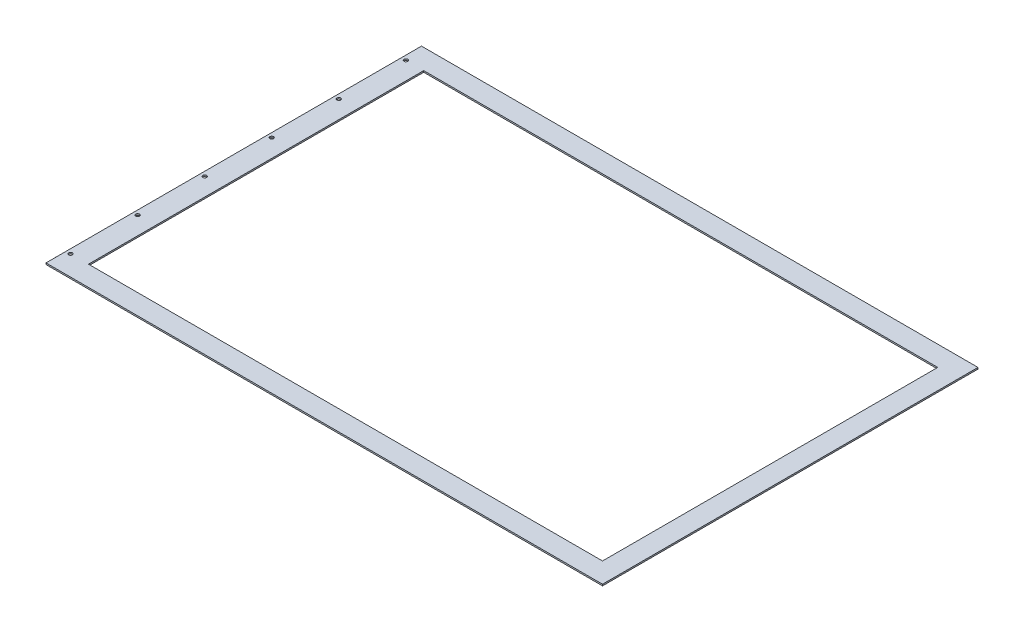
ISO-10303-21;
HEADER;
FILE_DESCRIPTION(('STEP AP214'),'2;1');
FILE_NAME('part.step','',(''),(''),'','','');
FILE_SCHEMA(('AUTOMOTIVE_DESIGN { 1 0 10303 214 1 1 1 1 }'));
ENDSEC;
DATA;
#1=APPLICATION_CONTEXT('core data for automotive mechanical design processes');
#2=APPLICATION_PROTOCOL_DEFINITION('international standard','automotive_design',2000,#1);
#3=PRODUCT_CONTEXT('',#1,'mechanical');
#4=PRODUCT('Part','Part','',(#3));
#5=PRODUCT_RELATED_PRODUCT_CATEGORY('part','',(#4));
#6=PRODUCT_DEFINITION_FORMATION('','',#4);
#7=PRODUCT_DEFINITION_CONTEXT('part definition',#1,'design');
#8=PRODUCT_DEFINITION('design','',#6,#7);
#9=PRODUCT_DEFINITION_SHAPE('','',#8);
#10=(LENGTH_UNIT() NAMED_UNIT(*) SI_UNIT(.MILLI.,.METRE.));
#11=(NAMED_UNIT(*) PLANE_ANGLE_UNIT() SI_UNIT($,.RADIAN.));
#12=(NAMED_UNIT(*) SI_UNIT($,.STERADIAN.) SOLID_ANGLE_UNIT());
#13=UNCERTAINTY_MEASURE_WITH_UNIT(LENGTH_MEASURE(1.E-05),#10,'distance_accuracy_value','');
#14=(GEOMETRIC_REPRESENTATION_CONTEXT(3) GLOBAL_UNCERTAINTY_ASSIGNED_CONTEXT((#13)) GLOBAL_UNIT_ASSIGNED_CONTEXT((#10,
#11,#12)) REPRESENTATION_CONTEXT('',''));
#15=CARTESIAN_POINT('',(0.,0.,0.));
#16=DIRECTION('',(0.,0.,1.));
#17=DIRECTION('',(1.,0.,0.));
#18=AXIS2_PLACEMENT_3D('',#15,#16,#17);
#19=CARTESIAN_POINT('',(0.,2.54,0.));
#20=DIRECTION('',(0.,-1.,0.));
#21=DIRECTION('',(0.,0.,-1.));
#22=AXIS2_PLACEMENT_3D('',#19,#20,#21);
#23=PLANE('',#22);
#24=CARTESIAN_POINT('',(-468.63,2.54,285.75));
#25=DIRECTION('',(0.,1.,0.));
#26=DIRECTION('',(0.,0.,1.));
#27=AXIS2_PLACEMENT_3D('',#24,#25,#26);
#28=CIRCLE('',#27,3.17499999999998);
#29=CARTESIAN_POINT('',(-468.63,2.54,288.925));
#30=VERTEX_POINT('',#29);
#31=EDGE_CURVE('E290',#30,#30,#28,.T.);
#32=ORIENTED_EDGE('',*,*,#31,.F.);
#33=EDGE_LOOP('',(#32));
#34=FACE_BOUND('',#33,.T.);
#35=CARTESIAN_POINT('',(-468.63,2.54,171.45));
#36=DIRECTION('',(0.,1.,0.));
#37=DIRECTION('',(0.,0.,1.));
#38=AXIS2_PLACEMENT_3D('',#35,#36,#37);
#39=CIRCLE('',#38,3.17499999999998);
#40=CARTESIAN_POINT('',(-468.63,2.54,174.625));
#41=VERTEX_POINT('',#40);
#42=EDGE_CURVE('E294',#41,#41,#39,.T.);
#43=ORIENTED_EDGE('',*,*,#42,.F.);
#44=EDGE_LOOP('',(#43));
#45=FACE_BOUND('',#44,.T.);
#46=CARTESIAN_POINT('',(-468.63,2.54,57.15));
#47=DIRECTION('',(0.,1.,0.));
#48=DIRECTION('',(0.,0.,1.));
#49=AXIS2_PLACEMENT_3D('',#46,#47,#48);
#50=CIRCLE('',#49,3.17499999999998);
#51=CARTESIAN_POINT('',(-468.63,2.54,60.325));
#52=VERTEX_POINT('',#51);
#53=EDGE_CURVE('E304',#52,#52,#50,.T.);
#54=ORIENTED_EDGE('',*,*,#53,.F.);
#55=EDGE_LOOP('',(#54));
#56=FACE_BOUND('',#55,.T.);
#57=CARTESIAN_POINT('',(-468.63,2.54,-57.15));
#58=DIRECTION('',(0.,1.,0.));
#59=DIRECTION('',(0.,0.,1.));
#60=AXIS2_PLACEMENT_3D('',#57,#58,#59);
#61=CIRCLE('',#60,3.17499999999998);
#62=CARTESIAN_POINT('',(-468.63,2.54,-53.975));
#63=VERTEX_POINT('',#62);
#64=EDGE_CURVE('E312',#63,#63,#61,.T.);
#65=ORIENTED_EDGE('',*,*,#64,.F.);
#66=EDGE_LOOP('',(#65));
#67=FACE_BOUND('',#66,.T.);
#68=CARTESIAN_POINT('',(-468.63,2.54,-171.45));
#69=DIRECTION('',(0.,1.,0.));
#70=DIRECTION('',(0.,0.,1.));
#71=AXIS2_PLACEMENT_3D('',#68,#69,#70);
#72=CIRCLE('',#71,3.17499999999998);
#73=CARTESIAN_POINT('',(-468.63,2.54,-168.275));
#74=VERTEX_POINT('',#73);
#75=EDGE_CURVE('E320',#74,#74,#72,.T.);
#76=ORIENTED_EDGE('',*,*,#75,.F.);
#77=EDGE_LOOP('',(#76));
#78=FACE_BOUND('',#77,.T.);
#79=CARTESIAN_POINT('',(-468.63,2.54,-285.75));
#80=DIRECTION('',(0.,1.,0.));
#81=DIRECTION('',(0.,0.,1.));
#82=AXIS2_PLACEMENT_3D('',#79,#80,#81);
#83=CIRCLE('',#82,3.17499999999998);
#84=CARTESIAN_POINT('',(-468.63,2.54,-282.575));
#85=VERTEX_POINT('',#84);
#86=EDGE_CURVE('E328',#85,#85,#83,.T.);
#87=ORIENTED_EDGE('',*,*,#86,.F.);
#88=EDGE_LOOP('',(#87));
#89=FACE_BOUND('',#88,.T.);
#90=DIRECTION('',(0.,0.,-1.));
#91=VECTOR('',#90,1.);
#92=CARTESIAN_POINT('',(472.44,2.54,320.04));
#93=LINE('',#92,#91);
#94=CARTESIAN_POINT('',(472.44,2.54,320.04));
#95=VERTEX_POINT('',#94);
#96=CARTESIAN_POINT('',(472.44,2.54,-320.04));
#97=VERTEX_POINT('',#96);
#98=EDGE_CURVE('E170',#95,#97,#93,.T.);
#99=ORIENTED_EDGE('',*,*,#98,.T.);
#100=DIRECTION('',(-1.,0.,0.));
#101=VECTOR('',#100,1.);
#102=CARTESIAN_POINT('',(-472.44,2.54,-320.04));
#103=LINE('',#102,#101);
#104=CARTESIAN_POINT('',(-476.25,2.54,-320.04));
#105=VERTEX_POINT('',#104);
#106=EDGE_CURVE('E174',#97,#105,#103,.T.);
#107=ORIENTED_EDGE('',*,*,#106,.T.);
#108=DIRECTION('',(0.,0.,1.));
#109=VECTOR('',#108,1.);
#110=CARTESIAN_POINT('',(-476.25,2.54,-320.04));
#111=LINE('',#110,#109);
#112=CARTESIAN_POINT('',(-476.25,2.54,320.04));
#113=VERTEX_POINT('',#112);
#114=EDGE_CURVE('E178',#105,#113,#111,.T.);
#115=ORIENTED_EDGE('',*,*,#114,.T.);
#116=DIRECTION('',(1.,0.,0.));
#117=VECTOR('',#116,1.);
#118=CARTESIAN_POINT('',(-476.25,2.54,320.04));
#119=LINE('',#118,#117);
#120=EDGE_CURVE('E181',#113,#95,#119,.T.);
#121=ORIENTED_EDGE('',*,*,#120,.T.);
#122=EDGE_LOOP('',(#99,#107,#115,#121));
#123=FACE_BOUND('',#122,.T.);
#124=DIRECTION('',(0.,0.,-1.));
#125=VECTOR('',#124,1.);
#126=CARTESIAN_POINT('',(438.15,2.54,285.75));
#127=LINE('',#126,#125);
#128=CARTESIAN_POINT('',(438.15,2.54,285.75));
#129=VERTEX_POINT('',#128);
#130=CARTESIAN_POINT('',(438.15,2.54,-285.75));
#131=VERTEX_POINT('',#130);
#132=EDGE_CURVE('E120',#129,#131,#127,.T.);
#133=ORIENTED_EDGE('',*,*,#132,.F.);
#134=DIRECTION('',(1.,0.,0.));
#135=VECTOR('',#134,1.);
#136=CARTESIAN_POINT('',(-438.15,2.54,285.75));
#137=LINE('',#136,#135);
#138=CARTESIAN_POINT('',(-438.15,2.54,285.75));
#139=VERTEX_POINT('',#138);
#140=EDGE_CURVE('E147',#139,#129,#137,.T.);
#141=ORIENTED_EDGE('',*,*,#140,.F.);
#142=DIRECTION('',(0.,0.,1.));
#143=VECTOR('',#142,1.);
#144=CARTESIAN_POINT('',(-438.15,2.54,285.75));
#145=LINE('',#144,#143);
#146=CARTESIAN_POINT('',(-438.15,2.54,-285.75));
#147=VERTEX_POINT('',#146);
#148=EDGE_CURVE('E141',#147,#139,#145,.T.);
#149=ORIENTED_EDGE('',*,*,#148,.F.);
#150=DIRECTION('',(-1.,0.,0.));
#151=VECTOR('',#150,1.);
#152=CARTESIAN_POINT('',(-438.15,2.54,-285.75));
#153=LINE('',#152,#151);
#154=EDGE_CURVE('E129',#131,#147,#153,.T.);
#155=ORIENTED_EDGE('',*,*,#154,.F.);
#156=EDGE_LOOP('',(#133,#141,#149,#155));
#157=FACE_BOUND('',#156,.T.);
#158=ADVANCED_FACE('F43',(#34,#45,#56,#67,#78,#89,#123,#157),#23,.F.);
#159=CARTESIAN_POINT('',(0.,0.,0.));
#160=DIRECTION('',(0.,-1.,0.));
#161=DIRECTION('',(0.,0.,-1.));
#162=AXIS2_PLACEMENT_3D('',#159,#160,#161);
#163=PLANE('',#162);
#164=CARTESIAN_POINT('',(-468.63,0.,285.75));
#165=DIRECTION('',(0.,1.,0.));
#166=DIRECTION('',(0.,0.,1.));
#167=AXIS2_PLACEMENT_3D('',#164,#165,#166);
#168=CIRCLE('',#167,3.17499999999998);
#169=CARTESIAN_POINT('',(-468.63,0.,288.925));
#170=VERTEX_POINT('',#169);
#171=EDGE_CURVE('E288',#170,#170,#168,.T.);
#172=ORIENTED_EDGE('',*,*,#171,.T.);
#173=EDGE_LOOP('',(#172));
#174=FACE_BOUND('',#173,.T.);
#175=CARTESIAN_POINT('',(-468.63,0.,171.45));
#176=DIRECTION('',(0.,1.,0.));
#177=DIRECTION('',(0.,0.,1.));
#178=AXIS2_PLACEMENT_3D('',#175,#176,#177);
#179=CIRCLE('',#178,3.17499999999998);
#180=CARTESIAN_POINT('',(-468.63,0.,174.625));
#181=VERTEX_POINT('',#180);
#182=EDGE_CURVE('E300',#181,#181,#179,.T.);
#183=ORIENTED_EDGE('',*,*,#182,.T.);
#184=EDGE_LOOP('',(#183));
#185=FACE_BOUND('',#184,.T.);
#186=CARTESIAN_POINT('',(-468.63,0.,57.15));
#187=DIRECTION('',(0.,1.,0.));
#188=DIRECTION('',(0.,0.,1.));
#189=AXIS2_PLACEMENT_3D('',#186,#187,#188);
#190=CIRCLE('',#189,3.17499999999998);
#191=CARTESIAN_POINT('',(-468.63,0.,60.325));
#192=VERTEX_POINT('',#191);
#193=EDGE_CURVE('E308',#192,#192,#190,.T.);
#194=ORIENTED_EDGE('',*,*,#193,.T.);
#195=EDGE_LOOP('',(#194));
#196=FACE_BOUND('',#195,.T.);
#197=CARTESIAN_POINT('',(-468.63,0.,-57.15));
#198=DIRECTION('',(0.,1.,0.));
#199=DIRECTION('',(0.,0.,1.));
#200=AXIS2_PLACEMENT_3D('',#197,#198,#199);
#201=CIRCLE('',#200,3.17499999999998);
#202=CARTESIAN_POINT('',(-468.63,0.,-53.975));
#203=VERTEX_POINT('',#202);
#204=EDGE_CURVE('E316',#203,#203,#201,.T.);
#205=ORIENTED_EDGE('',*,*,#204,.T.);
#206=EDGE_LOOP('',(#205));
#207=FACE_BOUND('',#206,.T.);
#208=CARTESIAN_POINT('',(-468.63,0.,-171.45));
#209=DIRECTION('',(0.,1.,0.));
#210=DIRECTION('',(0.,0.,1.));
#211=AXIS2_PLACEMENT_3D('',#208,#209,#210);
#212=CIRCLE('',#211,3.17499999999998);
#213=CARTESIAN_POINT('',(-468.63,0.,-168.275));
#214=VERTEX_POINT('',#213);
#215=EDGE_CURVE('E324',#214,#214,#212,.T.);
#216=ORIENTED_EDGE('',*,*,#215,.T.);
#217=EDGE_LOOP('',(#216));
#218=FACE_BOUND('',#217,.T.);
#219=CARTESIAN_POINT('',(-468.63,0.,-285.75));
#220=DIRECTION('',(0.,1.,0.));
#221=DIRECTION('',(0.,0.,1.));
#222=AXIS2_PLACEMENT_3D('',#219,#220,#221);
#223=CIRCLE('',#222,3.17499999999998);
#224=CARTESIAN_POINT('',(-468.63,0.,-282.575));
#225=VERTEX_POINT('',#224);
#226=EDGE_CURVE('E155',#225,#225,#223,.T.);
#227=ORIENTED_EDGE('',*,*,#226,.T.);
#228=EDGE_LOOP('',(#227));
#229=FACE_BOUND('',#228,.T.);
#230=DIRECTION('',(0.,0.,-1.));
#231=VECTOR('',#230,1.);
#232=CARTESIAN_POINT('',(472.44,0.,320.04));
#233=LINE('',#232,#231);
#234=CARTESIAN_POINT('',(472.44,0.,320.04));
#235=VERTEX_POINT('',#234);
#236=CARTESIAN_POINT('',(472.44,0.,-320.04));
#237=VERTEX_POINT('',#236);
#238=EDGE_CURVE('E137',#235,#237,#233,.T.);
#239=ORIENTED_EDGE('',*,*,#238,.F.);
#240=DIRECTION('',(1.,0.,0.));
#241=VECTOR('',#240,1.);
#242=CARTESIAN_POINT('',(-472.44,0.,320.04));
#243=LINE('',#242,#241);
#244=CARTESIAN_POINT('',(-476.25,0.,320.04));
#245=VERTEX_POINT('',#244);
#246=EDGE_CURVE('E175',#245,#235,#243,.T.);
#247=ORIENTED_EDGE('',*,*,#246,.F.);
#248=DIRECTION('',(0.,0.,1.));
#249=VECTOR('',#248,1.);
#250=CARTESIAN_POINT('',(-476.25,0.,-320.04));
#251=LINE('',#250,#249);
#252=CARTESIAN_POINT('',(-476.25,0.,-320.04));
#253=VERTEX_POINT('',#252);
#254=EDGE_CURVE('E190',#253,#245,#251,.T.);
#255=ORIENTED_EDGE('',*,*,#254,.F.);
#256=DIRECTION('',(-1.,0.,0.));
#257=VECTOR('',#256,1.);
#258=CARTESIAN_POINT('',(-472.44,0.,-320.04));
#259=LINE('',#258,#257);
#260=EDGE_CURVE('E188',#237,#253,#259,.T.);
#261=ORIENTED_EDGE('',*,*,#260,.F.);
#262=EDGE_LOOP('',(#239,#247,#255,#261));
#263=FACE_BOUND('',#262,.T.);
#264=DIRECTION('',(1.,0.,0.));
#265=VECTOR('',#264,1.);
#266=CARTESIAN_POINT('',(-438.15,0.,285.75));
#267=LINE('',#266,#265);
#268=CARTESIAN_POINT('',(-438.15,0.,285.75));
#269=VERTEX_POINT('',#268);
#270=CARTESIAN_POINT('',(438.15,0.,285.75));
#271=VERTEX_POINT('',#270);
#272=EDGE_CURVE('E130',#269,#271,#267,.T.);
#273=ORIENTED_EDGE('',*,*,#272,.T.);
#274=DIRECTION('',(0.,0.,-1.));
#275=VECTOR('',#274,1.);
#276=CARTESIAN_POINT('',(438.15,0.,285.75));
#277=LINE('',#276,#275);
#278=CARTESIAN_POINT('',(438.15,0.,-285.75));
#279=VERTEX_POINT('',#278);
#280=EDGE_CURVE('E72',#271,#279,#277,.T.);
#281=ORIENTED_EDGE('',*,*,#280,.T.);
#282=DIRECTION('',(-1.,0.,0.));
#283=VECTOR('',#282,1.);
#284=CARTESIAN_POINT('',(-438.15,0.,-285.75));
#285=LINE('',#284,#283);
#286=CARTESIAN_POINT('',(-438.15,0.,-285.75));
#287=VERTEX_POINT('',#286);
#288=EDGE_CURVE('E136',#279,#287,#285,.T.);
#289=ORIENTED_EDGE('',*,*,#288,.T.);
#290=DIRECTION('',(0.,0.,1.));
#291=VECTOR('',#290,1.);
#292=CARTESIAN_POINT('',(-438.15,0.,285.75));
#293=LINE('',#292,#291);
#294=EDGE_CURVE('E157',#287,#269,#293,.T.);
#295=ORIENTED_EDGE('',*,*,#294,.T.);
#296=EDGE_LOOP('',(#273,#281,#289,#295));
#297=FACE_BOUND('',#296,.T.);
#298=ADVANCED_FACE('F213',(#174,#185,#196,#207,#218,#229,#263,#297),#163,.T.);
#299=CARTESIAN_POINT('',(472.44,2.54,320.04));
#300=DIRECTION('',(-1.,0.,0.));
#301=DIRECTION('',(0.,0.,1.));
#302=AXIS2_PLACEMENT_3D('',#299,#300,#301);
#303=PLANE('',#302);
#304=ORIENTED_EDGE('',*,*,#238,.T.);
#305=DIRECTION('',(0.,-1.,0.));
#306=VECTOR('',#305,1.);
#307=CARTESIAN_POINT('',(472.44,2.54,-320.04));
#308=LINE('',#307,#306);
#309=EDGE_CURVE('E11',#97,#237,#308,.T.);
#310=ORIENTED_EDGE('',*,*,#309,.F.);
#311=ORIENTED_EDGE('',*,*,#98,.F.);
#312=DIRECTION('',(0.,-1.,0.));
#313=VECTOR('',#312,1.);
#314=CARTESIAN_POINT('',(472.44,2.54,320.04));
#315=LINE('',#314,#313);
#316=EDGE_CURVE('E184',#95,#235,#315,.T.);
#317=ORIENTED_EDGE('',*,*,#316,.T.);
#318=EDGE_LOOP('',(#304,#310,#311,#317));
#319=FACE_BOUND('',#318,.T.);
#320=ADVANCED_FACE('F45',(#319),#303,.F.);
#321=CARTESIAN_POINT('',(-472.44,2.54,-320.04));
#322=DIRECTION('',(0.,0.,1.));
#323=DIRECTION('',(1.,0.,0.));
#324=AXIS2_PLACEMENT_3D('',#321,#322,#323);
#325=PLANE('',#324);
#326=ORIENTED_EDGE('',*,*,#260,.T.);
#327=DIRECTION('',(0.,-1.,0.));
#328=VECTOR('',#327,1.);
#329=CARTESIAN_POINT('',(-476.25,2.54,-320.04));
#330=LINE('',#329,#328);
#331=EDGE_CURVE('E51',#105,#253,#330,.T.);
#332=ORIENTED_EDGE('',*,*,#331,.F.);
#333=ORIENTED_EDGE('',*,*,#106,.F.);
#334=ORIENTED_EDGE('',*,*,#309,.T.);
#335=EDGE_LOOP('',(#326,#332,#333,#334));
#336=FACE_BOUND('',#335,.T.);
#337=ADVANCED_FACE('F223',(#336),#325,.F.);
#338=CARTESIAN_POINT('',(-476.25,2.54,-320.04));
#339=DIRECTION('',(1.,0.,0.));
#340=DIRECTION('',(0.,0.,-1.));
#341=AXIS2_PLACEMENT_3D('',#338,#339,#340);
#342=PLANE('',#341);
#343=ORIENTED_EDGE('',*,*,#254,.T.);
#344=DIRECTION('',(0.,-1.,0.));
#345=VECTOR('',#344,1.);
#346=CARTESIAN_POINT('',(-476.25,2.54,320.04));
#347=LINE('',#346,#345);
#348=EDGE_CURVE('E199',#113,#245,#347,.T.);
#349=ORIENTED_EDGE('',*,*,#348,.F.);
#350=ORIENTED_EDGE('',*,*,#114,.F.);
#351=ORIENTED_EDGE('',*,*,#331,.T.);
#352=EDGE_LOOP('',(#343,#349,#350,#351));
#353=FACE_BOUND('',#352,.T.);
#354=ADVANCED_FACE('F208',(#353),#342,.F.);
#355=CARTESIAN_POINT('',(-472.44,2.54,320.04));
#356=DIRECTION('',(0.,0.,-1.));
#357=DIRECTION('',(-1.,0.,0.));
#358=AXIS2_PLACEMENT_3D('',#355,#356,#357);
#359=PLANE('',#358);
#360=ORIENTED_EDGE('',*,*,#246,.T.);
#361=ORIENTED_EDGE('',*,*,#316,.F.);
#362=ORIENTED_EDGE('',*,*,#120,.F.);
#363=ORIENTED_EDGE('',*,*,#348,.T.);
#364=EDGE_LOOP('',(#360,#361,#362,#363));
#365=FACE_BOUND('',#364,.T.);
#366=ADVANCED_FACE('F217',(#365),#359,.F.);
#367=CARTESIAN_POINT('',(438.15,2.54,285.75));
#368=DIRECTION('',(-1.,0.,0.));
#369=DIRECTION('',(0.,0.,1.));
#370=AXIS2_PLACEMENT_3D('',#367,#368,#369);
#371=PLANE('',#370);
#372=ORIENTED_EDGE('',*,*,#280,.F.);
#373=DIRECTION('',(0.,-1.,0.));
#374=VECTOR('',#373,1.);
#375=CARTESIAN_POINT('',(438.15,2.54,285.75));
#376=LINE('',#375,#374);
#377=EDGE_CURVE('E124',#129,#271,#376,.T.);
#378=ORIENTED_EDGE('',*,*,#377,.F.);
#379=ORIENTED_EDGE('',*,*,#132,.T.);
#380=DIRECTION('',(0.,-1.,0.));
#381=VECTOR('',#380,1.);
#382=CARTESIAN_POINT('',(438.15,2.54,-285.75));
#383=LINE('',#382,#381);
#384=EDGE_CURVE('E123',#131,#279,#383,.T.);
#385=ORIENTED_EDGE('',*,*,#384,.T.);
#386=EDGE_LOOP('',(#372,#378,#379,#385));
#387=FACE_BOUND('',#386,.T.);
#388=ADVANCED_FACE('F122',(#387),#371,.T.);
#389=CARTESIAN_POINT('',(-438.15,2.54,-285.75));
#390=DIRECTION('',(0.,0.,1.));
#391=DIRECTION('',(1.,0.,0.));
#392=AXIS2_PLACEMENT_3D('',#389,#390,#391);
#393=PLANE('',#392);
#394=ORIENTED_EDGE('',*,*,#288,.F.);
#395=ORIENTED_EDGE('',*,*,#384,.F.);
#396=ORIENTED_EDGE('',*,*,#154,.T.);
#397=DIRECTION('',(0.,-1.,0.));
#398=VECTOR('',#397,1.);
#399=CARTESIAN_POINT('',(-438.15,2.54,-285.75));
#400=LINE('',#399,#398);
#401=EDGE_CURVE('E138',#147,#287,#400,.T.);
#402=ORIENTED_EDGE('',*,*,#401,.T.);
#403=EDGE_LOOP('',(#394,#395,#396,#402));
#404=FACE_BOUND('',#403,.T.);
#405=ADVANCED_FACE('F133',(#404),#393,.T.);
#406=CARTESIAN_POINT('',(-438.15,2.54,285.75));
#407=DIRECTION('',(1.,0.,0.));
#408=DIRECTION('',(0.,0.,-1.));
#409=AXIS2_PLACEMENT_3D('',#406,#407,#408);
#410=PLANE('',#409);
#411=ORIENTED_EDGE('',*,*,#294,.F.);
#412=ORIENTED_EDGE('',*,*,#401,.F.);
#413=ORIENTED_EDGE('',*,*,#148,.T.);
#414=DIRECTION('',(0.,-1.,0.));
#415=VECTOR('',#414,1.);
#416=CARTESIAN_POINT('',(-438.15,2.54,285.75));
#417=LINE('',#416,#415);
#418=EDGE_CURVE('E61',#139,#269,#417,.T.);
#419=ORIENTED_EDGE('',*,*,#418,.T.);
#420=EDGE_LOOP('',(#411,#412,#413,#419));
#421=FACE_BOUND('',#420,.T.);
#422=ADVANCED_FACE('F250',(#421),#410,.T.);
#423=CARTESIAN_POINT('',(-438.15,2.54,285.75));
#424=DIRECTION('',(0.,0.,-1.));
#425=DIRECTION('',(-1.,0.,0.));
#426=AXIS2_PLACEMENT_3D('',#423,#424,#425);
#427=PLANE('',#426);
#428=ORIENTED_EDGE('',*,*,#272,.F.);
#429=ORIENTED_EDGE('',*,*,#418,.F.);
#430=ORIENTED_EDGE('',*,*,#140,.T.);
#431=ORIENTED_EDGE('',*,*,#377,.T.);
#432=EDGE_LOOP('',(#428,#429,#430,#431));
#433=FACE_BOUND('',#432,.T.);
#434=ADVANCED_FACE('F254',(#433),#427,.T.);
#435=CARTESIAN_POINT('',(-468.63,2.54,-285.75));
#436=DIRECTION('',(0.,1.,0.));
#437=DIRECTION('',(0.,0.,1.));
#438=AXIS2_PLACEMENT_3D('',#435,#436,#437);
#439=CYLINDRICAL_SURFACE('',#438,3.17499999999998);
#440=ORIENTED_EDGE('',*,*,#226,.F.);
#441=EDGE_LOOP('',(#440));
#442=FACE_BOUND('',#441,.T.);
#443=ORIENTED_EDGE('',*,*,#86,.T.);
#444=EDGE_LOOP('',(#443));
#445=FACE_BOUND('',#444,.T.);
#446=ADVANCED_FACE('F260',(#442,#445),#439,.F.);
#447=CARTESIAN_POINT('',(-468.63,2.54,-171.45));
#448=DIRECTION('',(0.,1.,0.));
#449=DIRECTION('',(0.,0.,1.));
#450=AXIS2_PLACEMENT_3D('',#447,#448,#449);
#451=CYLINDRICAL_SURFACE('',#450,3.17499999999998);
#452=ORIENTED_EDGE('',*,*,#215,.F.);
#453=EDGE_LOOP('',(#452));
#454=FACE_BOUND('',#453,.T.);
#455=ORIENTED_EDGE('',*,*,#75,.T.);
#456=EDGE_LOOP('',(#455));
#457=FACE_BOUND('',#456,.T.);
#458=ADVANCED_FACE('F263',(#454,#457),#451,.F.);
#459=CARTESIAN_POINT('',(-468.63,2.54,-57.15));
#460=DIRECTION('',(0.,1.,0.));
#461=DIRECTION('',(0.,0.,1.));
#462=AXIS2_PLACEMENT_3D('',#459,#460,#461);
#463=CYLINDRICAL_SURFACE('',#462,3.17499999999998);
#464=ORIENTED_EDGE('',*,*,#204,.F.);
#465=EDGE_LOOP('',(#464));
#466=FACE_BOUND('',#465,.T.);
#467=ORIENTED_EDGE('',*,*,#64,.T.);
#468=EDGE_LOOP('',(#467));
#469=FACE_BOUND('',#468,.T.);
#470=ADVANCED_FACE('F267',(#466,#469),#463,.F.);
#471=CARTESIAN_POINT('',(-468.63,2.54,57.15));
#472=DIRECTION('',(0.,1.,0.));
#473=DIRECTION('',(0.,0.,1.));
#474=AXIS2_PLACEMENT_3D('',#471,#472,#473);
#475=CYLINDRICAL_SURFACE('',#474,3.17499999999998);
#476=ORIENTED_EDGE('',*,*,#193,.F.);
#477=EDGE_LOOP('',(#476));
#478=FACE_BOUND('',#477,.T.);
#479=ORIENTED_EDGE('',*,*,#53,.T.);
#480=EDGE_LOOP('',(#479));
#481=FACE_BOUND('',#480,.T.);
#482=ADVANCED_FACE('F271',(#478,#481),#475,.F.);
#483=CARTESIAN_POINT('',(-468.63,2.54,171.45));
#484=DIRECTION('',(0.,1.,0.));
#485=DIRECTION('',(0.,0.,1.));
#486=AXIS2_PLACEMENT_3D('',#483,#484,#485);
#487=CYLINDRICAL_SURFACE('',#486,3.17499999999998);
#488=ORIENTED_EDGE('',*,*,#182,.F.);
#489=EDGE_LOOP('',(#488));
#490=FACE_BOUND('',#489,.T.);
#491=ORIENTED_EDGE('',*,*,#42,.T.);
#492=EDGE_LOOP('',(#491));
#493=FACE_BOUND('',#492,.T.);
#494=ADVANCED_FACE('F275',(#490,#493),#487,.F.);
#495=CARTESIAN_POINT('',(-468.63,2.54,285.75));
#496=DIRECTION('',(0.,1.,0.));
#497=DIRECTION('',(0.,0.,1.));
#498=AXIS2_PLACEMENT_3D('',#495,#496,#497);
#499=CYLINDRICAL_SURFACE('',#498,3.17499999999998);
#500=ORIENTED_EDGE('',*,*,#171,.F.);
#501=EDGE_LOOP('',(#500));
#502=FACE_BOUND('',#501,.T.);
#503=ORIENTED_EDGE('',*,*,#31,.T.);
#504=EDGE_LOOP('',(#503));
#505=FACE_BOUND('',#504,.T.);
#506=ADVANCED_FACE('F279',(#502,#505),#499,.F.);
#507=CLOSED_SHELL('',(#158,#298,#320,#337,#354,#366,#388,#405,#422,#434,#446,#458,#470,#482,
#494,#506));
#508=MANIFOLD_SOLID_BREP('B2',#507);
#509=ADVANCED_BREP_SHAPE_REPRESENTATION('',(#18,#508),#14);
#510=SHAPE_DEFINITION_REPRESENTATION(#9,#509);
ENDSEC;
END-ISO-10303-21;
